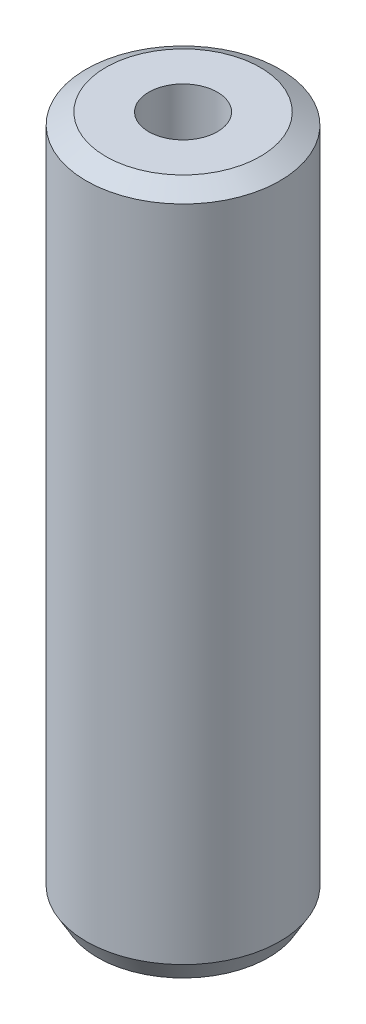
ISO-10303-21;
HEADER;
FILE_DESCRIPTION(('STEP AP214'),'2;1');
FILE_NAME('part.step','',(''),(''),'','','');
FILE_SCHEMA(('AUTOMOTIVE_DESIGN { 1 0 10303 214 1 1 1 1 }'));
ENDSEC;
DATA;
#1=APPLICATION_CONTEXT('core data for automotive mechanical design processes');
#2=APPLICATION_PROTOCOL_DEFINITION('international standard','automotive_design',2000,#1);
#3=PRODUCT_CONTEXT('',#1,'mechanical');
#4=PRODUCT('Part','Part','',(#3));
#5=PRODUCT_RELATED_PRODUCT_CATEGORY('part','',(#4));
#6=PRODUCT_DEFINITION_FORMATION('','',#4);
#7=PRODUCT_DEFINITION_CONTEXT('part definition',#1,'design');
#8=PRODUCT_DEFINITION('design','',#6,#7);
#9=PRODUCT_DEFINITION_SHAPE('','',#8);
#10=(LENGTH_UNIT() NAMED_UNIT(*) SI_UNIT(.MILLI.,.METRE.));
#11=(NAMED_UNIT(*) PLANE_ANGLE_UNIT() SI_UNIT($,.RADIAN.));
#12=(NAMED_UNIT(*) SI_UNIT($,.STERADIAN.) SOLID_ANGLE_UNIT());
#13=UNCERTAINTY_MEASURE_WITH_UNIT(LENGTH_MEASURE(1.E-05),#10,'distance_accuracy_value','');
#14=(GEOMETRIC_REPRESENTATION_CONTEXT(3) GLOBAL_UNCERTAINTY_ASSIGNED_CONTEXT((#13)) GLOBAL_UNIT_ASSIGNED_CONTEXT((#10,
#11,#12)) REPRESENTATION_CONTEXT('',''));
#15=CARTESIAN_POINT('',(0.,0.,0.));
#16=DIRECTION('',(0.,0.,1.));
#17=DIRECTION('',(1.,0.,0.));
#18=AXIS2_PLACEMENT_3D('',#15,#16,#17);
#19=CARTESIAN_POINT('',(0.,35.6102793307399,0.));
#20=DIRECTION('',(0.,-1.,0.));
#21=DIRECTION('',(0.,0.,-1.));
#22=AXIS2_PLACEMENT_3D('',#19,#20,#21);
#23=CYLINDRICAL_SURFACE('',#22,5.);
#24=CARTESIAN_POINT('',(0.,35.026335154872,0.));
#25=DIRECTION('',(0.,1.,0.));
#26=DIRECTION('',(0.,0.,1.));
#27=AXIS2_PLACEMENT_3D('',#24,#25,#26);
#28=CIRCLE('',#27,5.);
#29=CARTESIAN_POINT('',(0.,35.026335154872,5.));
#30=VERTEX_POINT('',#29);
#31=EDGE_CURVE('E50',#30,#30,#28,.F.);
#32=ORIENTED_EDGE('',*,*,#31,.T.);
#33=EDGE_LOOP('',(#32));
#34=FACE_BOUND('',#33,.T.);
#35=CARTESIAN_POINT('',(0.,1.01142098138721,0.));
#36=DIRECTION('',(0.,1.,0.));
#37=DIRECTION('',(0.,0.,1.));
#38=AXIS2_PLACEMENT_3D('',#35,#36,#37);
#39=CIRCLE('',#38,5.);
#40=CARTESIAN_POINT('',(0.,1.01142098138721,5.));
#41=VERTEX_POINT('',#40);
#42=EDGE_CURVE('E51',#41,#41,#39,.T.);
#43=ORIENTED_EDGE('',*,*,#42,.T.);
#44=EDGE_LOOP('',(#43));
#45=FACE_BOUND('',#44,.T.);
#46=ADVANCED_FACE('F39',(#34,#45),#23,.T.);
#47=CARTESIAN_POINT('',(0.,35.6102793307399,0.));
#48=DIRECTION('',(0.,1.,0.));
#49=DIRECTION('',(0.,0.,1.));
#50=AXIS2_PLACEMENT_3D('',#47,#48,#49);
#51=PLANE('',#50);
#52=CARTESIAN_POINT('',(0.,35.6102793307399,0.));
#53=DIRECTION('',(0.,1.,0.));
#54=DIRECTION('',(0.,0.,1.));
#55=AXIS2_PLACEMENT_3D('',#52,#53,#54);
#56=CIRCLE('',#55,3.98857901861276);
#57=CARTESIAN_POINT('',(0.,35.6102793307399,3.98857901861276));
#58=VERTEX_POINT('',#57);
#59=EDGE_CURVE('E54',#58,#58,#56,.T.);
#60=ORIENTED_EDGE('',*,*,#59,.T.);
#61=EDGE_LOOP('',(#60));
#62=FACE_BOUND('',#61,.T.);
#63=CARTESIAN_POINT('',(0.,35.6102793307399,0.));
#64=DIRECTION('',(0.,1.,0.));
#65=DIRECTION('',(0.,0.,1.));
#66=AXIS2_PLACEMENT_3D('',#63,#64,#65);
#67=CIRCLE('',#66,1.77229605500223);
#68=CARTESIAN_POINT('',(0.,35.6102793307399,1.77229605500223));
#69=VERTEX_POINT('',#68);
#70=EDGE_CURVE('E58',#69,#69,#67,.T.);
#71=ORIENTED_EDGE('',*,*,#70,.F.);
#72=EDGE_LOOP('',(#71));
#73=FACE_BOUND('',#72,.T.);
#74=ADVANCED_FACE('F69',(#62,#73),#51,.T.);
#75=CARTESIAN_POINT('',(0.,0.,0.));
#76=DIRECTION('',(0.,1.,0.));
#77=DIRECTION('',(0.,0.,1.));
#78=AXIS2_PLACEMENT_3D('',#75,#76,#77);
#79=PLANE('',#78);
#80=CARTESIAN_POINT('',(0.,0.,0.));
#81=DIRECTION('',(0.,1.,0.));
#82=DIRECTION('',(0.,0.,1.));
#83=AXIS2_PLACEMENT_3D('',#80,#81,#82);
#84=CIRCLE('',#83,4.41605582413205);
#85=CARTESIAN_POINT('',(0.,0.,4.41605582413205));
#86=VERTEX_POINT('',#85);
#87=EDGE_CURVE('E10',#86,#86,#84,.F.);
#88=ORIENTED_EDGE('',*,*,#87,.T.);
#89=EDGE_LOOP('',(#88));
#90=FACE_BOUND('',#89,.T.);
#91=CARTESIAN_POINT('',(0.,0.,0.));
#92=DIRECTION('',(0.,1.,0.));
#93=DIRECTION('',(0.,0.,1.));
#94=AXIS2_PLACEMENT_3D('',#91,#92,#93);
#95=CIRCLE('',#94,1.77229605500223);
#96=CARTESIAN_POINT('',(0.,0.,1.77229605500223));
#97=VERTEX_POINT('',#96);
#98=EDGE_CURVE('E63',#97,#97,#95,.T.);
#99=ORIENTED_EDGE('',*,*,#98,.T.);
#100=EDGE_LOOP('',(#99));
#101=FACE_BOUND('',#100,.T.);
#102=ADVANCED_FACE('F75',(#90,#101),#79,.F.);
#103=CARTESIAN_POINT('',(0.,35.6102793307399,0.));
#104=DIRECTION('',(0.,-1.,0.));
#105=DIRECTION('',(0.,0.,-1.));
#106=AXIS2_PLACEMENT_3D('',#103,#104,#105);
#107=CYLINDRICAL_SURFACE('',#106,1.77229605500223);
#108=ORIENTED_EDGE('',*,*,#70,.T.);
#109=EDGE_LOOP('',(#108));
#110=FACE_BOUND('',#109,.T.);
#111=ORIENTED_EDGE('',*,*,#98,.F.);
#112=EDGE_LOOP('',(#111));
#113=FACE_BOUND('',#112,.T.);
#114=ADVANCED_FACE('F70',(#110,#113),#107,.F.);
#115=CARTESIAN_POINT('',(0.,35.6102793307399,0.));
#116=DIRECTION('',(0.,-1.,0.));
#117=DIRECTION('',(0.,0.,-1.));
#118=AXIS2_PLACEMENT_3D('',#115,#116,#117);
#119=CONICAL_SURFACE('',#118,3.98857901861276,1.04719755119659);
#120=ORIENTED_EDGE('',*,*,#31,.F.);
#121=EDGE_LOOP('',(#120));
#122=FACE_BOUND('',#121,.T.);
#123=ORIENTED_EDGE('',*,*,#59,.F.);
#124=EDGE_LOOP('',(#123));
#125=FACE_BOUND('',#124,.T.);
#126=ADVANCED_FACE('F81',(#122,#125),#119,.T.);
#127=CARTESIAN_POINT('',(0.,1.01142098138721,0.));
#128=DIRECTION('',(0.,1.,0.));
#129=DIRECTION('',(0.,0.,1.));
#130=AXIS2_PLACEMENT_3D('',#127,#128,#129);
#131=CONICAL_SURFACE('',#130,5.,0.523598775598303);
#132=ORIENTED_EDGE('',*,*,#87,.F.);
#133=EDGE_LOOP('',(#132));
#134=FACE_BOUND('',#133,.T.);
#135=ORIENTED_EDGE('',*,*,#42,.F.);
#136=EDGE_LOOP('',(#135));
#137=FACE_BOUND('',#136,.T.);
#138=ADVANCED_FACE('F45',(#134,#137),#131,.T.);
#139=CLOSED_SHELL('',(#46,#74,#102,#114,#126,#138));
#140=MANIFOLD_SOLID_BREP('B2',#139);
#141=ADVANCED_BREP_SHAPE_REPRESENTATION('',(#18,#140),#14);
#142=SHAPE_DEFINITION_REPRESENTATION(#9,#141);
ENDSEC;
END-ISO-10303-21;
